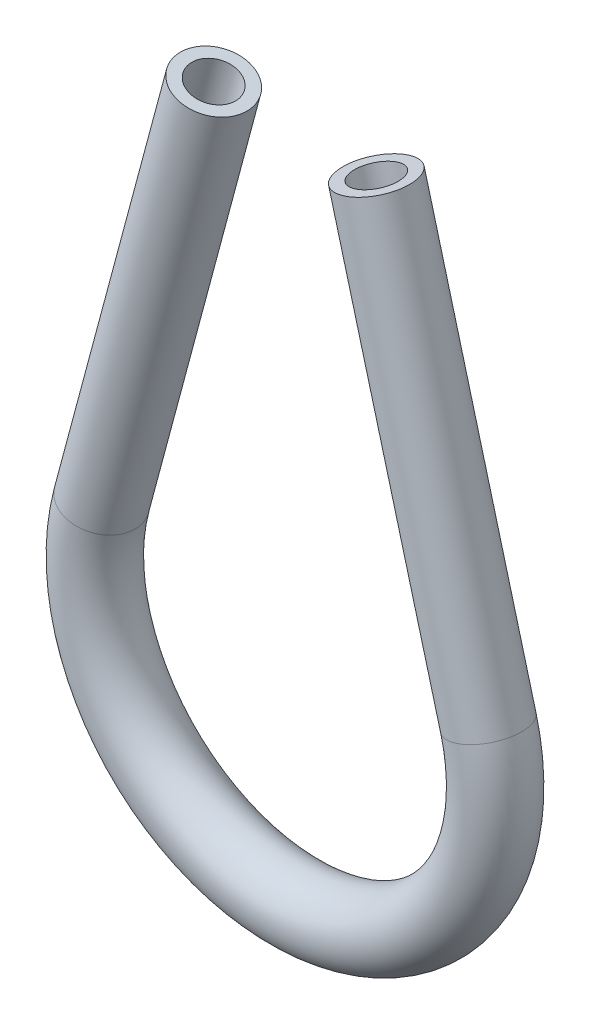
ISO-10303-21;
HEADER;
FILE_DESCRIPTION(('STEP AP214'),'2;1');
FILE_NAME('part.step','',(''),(''),'','','');
FILE_SCHEMA(('AUTOMOTIVE_DESIGN { 1 0 10303 214 1 1 1 1 }'));
ENDSEC;
DATA;
#1=APPLICATION_CONTEXT('core data for automotive mechanical design processes');
#2=APPLICATION_PROTOCOL_DEFINITION('international standard','automotive_design',2000,#1);
#3=PRODUCT_CONTEXT('',#1,'mechanical');
#4=PRODUCT('Part','Part','',(#3));
#5=PRODUCT_RELATED_PRODUCT_CATEGORY('part','',(#4));
#6=PRODUCT_DEFINITION_FORMATION('','',#4);
#7=PRODUCT_DEFINITION_CONTEXT('part definition',#1,'design');
#8=PRODUCT_DEFINITION('design','',#6,#7);
#9=PRODUCT_DEFINITION_SHAPE('','',#8);
#10=(LENGTH_UNIT() NAMED_UNIT(*) SI_UNIT(.MILLI.,.METRE.));
#11=(NAMED_UNIT(*) PLANE_ANGLE_UNIT() SI_UNIT($,.RADIAN.));
#12=(NAMED_UNIT(*) SI_UNIT($,.STERADIAN.) SOLID_ANGLE_UNIT());
#13=UNCERTAINTY_MEASURE_WITH_UNIT(LENGTH_MEASURE(1.E-05),#10,'distance_accuracy_value','');
#14=(GEOMETRIC_REPRESENTATION_CONTEXT(3) GLOBAL_UNCERTAINTY_ASSIGNED_CONTEXT((#13)) GLOBAL_UNIT_ASSIGNED_CONTEXT((#10,
#11,#12)) REPRESENTATION_CONTEXT('',''));
#15=CARTESIAN_POINT('',(0.,0.,0.));
#16=DIRECTION('',(0.,0.,1.));
#17=DIRECTION('',(1.,0.,0.));
#18=AXIS2_PLACEMENT_3D('',#15,#16,#17);
#19=CARTESIAN_POINT('',(-109.02377315918,-15.4299175134413,-4.9960036108132E-13));
#20=DIRECTION('',(0.258819045102515,-0.965925826289069,0.));
#21=DIRECTION('',(0.965925826289072,0.258819045102515,0.));
#22=AXIS2_PLACEMENT_3D('',#19,#20,#21);
#23=CYLINDRICAL_SURFACE('',#22,6.34999999999999);
#24=CARTESIAN_POINT('',(-88.3899767612724,-92.4362940234648,-2.77555756156289E-13));
#25=DIRECTION('',(0.258819045102515,-0.96592582628907,0.));
#26=DIRECTION('',(0.965925826289073,0.258819045102514,0.));
#27=AXIS2_PLACEMENT_3D('',#24,#25,#26);
#28=CIRCLE('',#27,6.34999999999999);
#29=CARTESIAN_POINT('',(-82.256347764337,-90.7927930870639,-2.34534455980989E-13));
#30=VERTEX_POINT('',#29);
#31=EDGE_CURVE('E78',#30,#30,#28,.T.);
#32=ORIENTED_EDGE('',*,*,#31,.F.);
#33=EDGE_LOOP('',(#32));
#34=FACE_BOUND('',#33,.T.);
#35=CARTESIAN_POINT('',(-109.02377315918,-15.4299175134413,-4.9960036108132E-13));
#36=DIRECTION('',(0.258819045102515,-0.96592582628907,0.));
#37=DIRECTION('',(0.965925826289073,0.258819045102514,0.));
#38=AXIS2_PLACEMENT_3D('',#35,#36,#37);
#39=CIRCLE('',#38,6.34999999999999);
#40=CARTESIAN_POINT('',(-102.890144162244,-13.7864165770404,-4.9960036108132E-13));
#41=VERTEX_POINT('',#40);
#42=EDGE_CURVE('E47',#41,#41,#39,.T.);
#43=ORIENTED_EDGE('',*,*,#42,.T.);
#44=EDGE_LOOP('',(#43));
#45=FACE_BOUND('',#44,.T.);
#46=ADVANCED_FACE('F32',(#34,#45),#23,.T.);
#47=CARTESIAN_POINT('',(-124.004465969192,-101.979167645573,-5.27355936696949E-13));
#48=DIRECTION('',(0.,0.,-1.));
#49=DIRECTION('',(-1.,0.,0.));
#50=AXIS2_PLACEMENT_3D('',#47,#48,#49);
#51=TOROIDAL_SURFACE('',#50,36.870832354431,6.34999999999999);
#52=CARTESIAN_POINT('',(-159.618955177111,-92.4362940234647,0.));
#53=DIRECTION('',(0.258819045102515,0.965925826289072,0.));
#54=DIRECTION('',(-0.965925826289068,0.258819045102515,0.));
#55=AXIS2_PLACEMENT_3D('',#52,#53,#54);
#56=CIRCLE('',#55,6.34999999999999);
#57=CARTESIAN_POINT('',(-165.752584174047,-90.7927930870636,1.23358464894082E-13));
#58=VERTEX_POINT('',#57);
#59=EDGE_CURVE('E36',#58,#58,#56,.T.);
#60=CARTESIAN_POINT('',(-124.004465969192,-101.979167645573,-5.27355936696949E-13));
#61=DIRECTION('',(0.,0.,-1.));
#62=DIRECTION('',(-1.,0.,0.));
#63=AXIS2_PLACEMENT_3D('',#60,#61,#62);
#64=CIRCLE('',#63,43.220832354431);
#65=EDGE_CURVE('',#30,#58,#64,.T.);
#66=ORIENTED_EDGE('',*,*,#31,.T.);
#67=ORIENTED_EDGE('',*,*,#59,.F.);
#68=ORIENTED_EDGE('',*,*,#65,.T.);
#69=ORIENTED_EDGE('',*,*,#65,.F.);
#70=EDGE_LOOP('',(#66,#68,#67,#69));
#71=FACE_BOUND('',#70,.T.);
#72=ADVANCED_FACE('F86',(#71),#51,.T.);
#73=CARTESIAN_POINT('',(-159.618955177111,-92.436294023465,-2.4980018054066E-13));
#74=DIRECTION('',(0.258819045102496,0.965925826289077,0.));
#75=DIRECTION('',(-0.965925826289073,0.258819045102497,0.));
#76=AXIS2_PLACEMENT_3D('',#73,#74,#75);
#77=CYLINDRICAL_SURFACE('',#76,6.34999999999999);
#78=CARTESIAN_POINT('',(-138.985158779206,-15.4299175134416,0.));
#79=DIRECTION('',(0.258819045102495,0.965925826289078,0.));
#80=DIRECTION('',(-0.965925826289073,0.258819045102495,0.));
#81=AXIS2_PLACEMENT_3D('',#78,#79,#80);
#82=CIRCLE('',#81,6.34999999999999);
#83=CARTESIAN_POINT('',(-145.118787776141,-13.7864165770404,-6.10622663543836E-13));
#84=VERTEX_POINT('',#83);
#85=EDGE_CURVE('E52',#84,#84,#82,.T.);
#86=ORIENTED_EDGE('',*,*,#85,.F.);
#87=EDGE_LOOP('',(#86));
#88=FACE_BOUND('',#87,.T.);
#89=ORIENTED_EDGE('',*,*,#59,.T.);
#90=EDGE_LOOP('',(#89));
#91=FACE_BOUND('',#90,.T.);
#92=ADVANCED_FACE('F34',(#88,#91),#77,.T.);
#93=CARTESIAN_POINT('',(-109.02377315918,-15.4299175134413,-4.9960036108132E-13));
#94=DIRECTION('',(0.258819045102515,-0.96592582628907,0.));
#95=DIRECTION('',(0.965925826289073,0.258819045102514,0.));
#96=AXIS2_PLACEMENT_3D('',#93,#94,#95);
#97=PLANE('',#96);
#98=CARTESIAN_POINT('',(-109.02377315918,-15.4299175134413,-4.9960036108132E-13));
#99=DIRECTION('',(0.258819045102515,-0.96592582628907,0.));
#100=DIRECTION('',(0.965925826289073,0.258819045102514,0.));
#101=AXIS2_PLACEMENT_3D('',#98,#99,#100);
#102=CIRCLE('',#101,4.16718750000001);
#103=CARTESIAN_POINT('',(-104.998579129941,-14.3513700239283,-4.71844785465692E-13));
#104=VERTEX_POINT('',#103);
#105=EDGE_CURVE('E73',#104,#104,#102,.F.);
#106=ORIENTED_EDGE('',*,*,#105,.F.);
#107=EDGE_LOOP('',(#106));
#108=FACE_BOUND('',#107,.T.);
#109=ORIENTED_EDGE('',*,*,#42,.F.);
#110=EDGE_LOOP('',(#109));
#111=FACE_BOUND('',#110,.T.);
#112=ADVANCED_FACE('F92',(#108,#111),#97,.F.);
#113=CARTESIAN_POINT('',(-138.985158779206,-15.4299175134416,0.));
#114=DIRECTION('',(0.258819045102495,0.965925826289078,0.));
#115=DIRECTION('',(-0.965925826289073,0.258819045102495,0.));
#116=AXIS2_PLACEMENT_3D('',#113,#114,#115);
#117=PLANE('',#116);
#118=CARTESIAN_POINT('',(-138.985158779206,-15.4299175134416,0.));
#119=DIRECTION('',(0.258819045102495,0.965925826289078,0.));
#120=DIRECTION('',(-0.965925826289073,0.258819045102495,0.));
#121=AXIS2_PLACEMENT_3D('',#118,#119,#120);
#122=CIRCLE('',#121,4.16718750000001);
#123=CARTESIAN_POINT('',(-143.010352808445,-14.3513700239286,-4.44089209850063E-13));
#124=VERTEX_POINT('',#123);
#125=EDGE_CURVE('E11',#124,#124,#122,.F.);
#126=ORIENTED_EDGE('',*,*,#125,.T.);
#127=EDGE_LOOP('',(#126));
#128=FACE_BOUND('',#127,.T.);
#129=ORIENTED_EDGE('',*,*,#85,.T.);
#130=EDGE_LOOP('',(#129));
#131=FACE_BOUND('',#130,.T.);
#132=ADVANCED_FACE('F59',(#128,#131),#117,.T.);
#133=CARTESIAN_POINT('',(-109.02377315918,-15.4299175134413,-4.9960036108132E-13));
#134=DIRECTION('',(0.258819045102515,-0.965925826289069,0.));
#135=DIRECTION('',(0.965925826289072,0.258819045102515,0.));
#136=AXIS2_PLACEMENT_3D('',#133,#134,#135);
#137=CYLINDRICAL_SURFACE('',#136,4.16718750000001);
#138=CARTESIAN_POINT('',(-88.3899767612724,-92.4362940234648,-2.77555756156289E-13));
#139=DIRECTION('',(0.258819045102515,-0.96592582628907,0.));
#140=DIRECTION('',(0.965925826289073,0.258819045102514,0.));
#141=AXIS2_PLACEMENT_3D('',#138,#139,#140);
#142=CIRCLE('',#141,4.16718750000001);
#143=CARTESIAN_POINT('',(-84.3647827320336,-91.3577465339517,-2.49323027916249E-13));
#144=VERTEX_POINT('',#143);
#145=EDGE_CURVE('E70',#144,#144,#142,.F.);
#146=ORIENTED_EDGE('',*,*,#145,.F.);
#147=EDGE_LOOP('',(#146));
#148=FACE_BOUND('',#147,.T.);
#149=ORIENTED_EDGE('',*,*,#105,.T.);
#150=EDGE_LOOP('',(#149));
#151=FACE_BOUND('',#150,.T.);
#152=ADVANCED_FACE('F100',(#148,#151),#137,.F.);
#153=CARTESIAN_POINT('',(-124.004465969192,-101.979167645573,-5.27355936696949E-13));
#154=DIRECTION('',(0.,0.,-1.));
#155=DIRECTION('',(-1.,0.,0.));
#156=AXIS2_PLACEMENT_3D('',#153,#154,#155);
#157=TOROIDAL_SURFACE('',#156,36.870832354431,4.16718750000001);
#158=CARTESIAN_POINT('',(-159.618955177111,-92.4362940234647,0.));
#159=DIRECTION('',(0.258819045102515,0.965925826289072,0.));
#160=DIRECTION('',(-0.965925826289068,0.258819045102515,0.));
#161=AXIS2_PLACEMENT_3D('',#158,#159,#160);
#162=CIRCLE('',#161,4.16718750000001);
#163=CARTESIAN_POINT('',(-163.644149206351,-91.3577465339514,0.));
#164=VERTEX_POINT('',#163);
#165=EDGE_CURVE('E41',#164,#164,#162,.F.);
#166=CARTESIAN_POINT('',(-124.004465969192,-101.979167645573,-5.27355936696949E-13));
#167=DIRECTION('',(0.,0.,-1.));
#168=DIRECTION('',(-1.,0.,0.));
#169=AXIS2_PLACEMENT_3D('',#166,#167,#168);
#170=CIRCLE('',#169,41.038019854431);
#171=EDGE_CURVE('',#144,#164,#170,.T.);
#172=ORIENTED_EDGE('',*,*,#145,.T.);
#173=ORIENTED_EDGE('',*,*,#165,.F.);
#174=ORIENTED_EDGE('',*,*,#171,.T.);
#175=ORIENTED_EDGE('',*,*,#171,.F.);
#176=EDGE_LOOP('',(#172,#174,#173,#175));
#177=FACE_BOUND('',#176,.T.);
#178=ADVANCED_FACE('F65',(#177),#157,.F.);
#179=CARTESIAN_POINT('',(-159.618955177111,-92.436294023465,-2.4980018054066E-13));
#180=DIRECTION('',(0.258819045102496,0.965925826289077,0.));
#181=DIRECTION('',(-0.965925826289073,0.258819045102497,0.));
#182=AXIS2_PLACEMENT_3D('',#179,#180,#181);
#183=CYLINDRICAL_SURFACE('',#182,4.16718750000001);
#184=ORIENTED_EDGE('',*,*,#125,.F.);
#185=EDGE_LOOP('',(#184));
#186=FACE_BOUND('',#185,.T.);
#187=ORIENTED_EDGE('',*,*,#165,.T.);
#188=EDGE_LOOP('',(#187));
#189=FACE_BOUND('',#188,.T.);
#190=ADVANCED_FACE('F62',(#186,#189),#183,.F.);
#191=CLOSED_SHELL('',(#46,#72,#92,#112,#132,#152,#178,#190));
#192=MANIFOLD_SOLID_BREP('B2',#191);
#193=ADVANCED_BREP_SHAPE_REPRESENTATION('',(#18,#192),#14);
#194=SHAPE_DEFINITION_REPRESENTATION(#9,#193);
ENDSEC;
END-ISO-10303-21;
